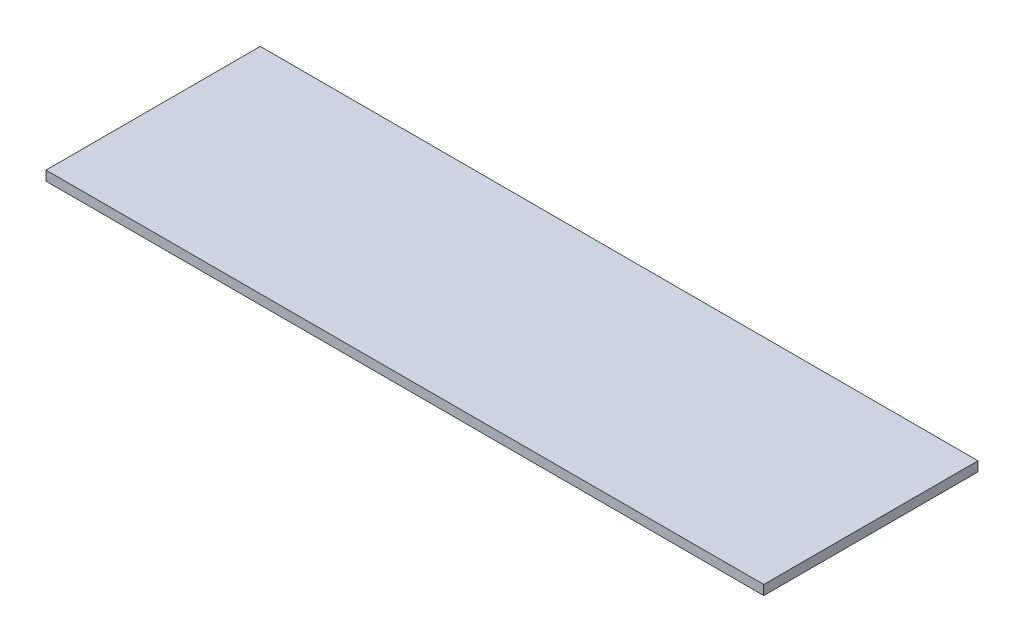
ISO-10303-21;
HEADER;
FILE_DESCRIPTION(('STEP AP214'),'2;1');
FILE_NAME('part.step','',(''),(''),'','','');
FILE_SCHEMA(('AUTOMOTIVE_DESIGN { 1 0 10303 214 1 1 1 1 }'));
ENDSEC;
DATA;
#1=APPLICATION_CONTEXT('core data for automotive mechanical design processes');
#2=APPLICATION_PROTOCOL_DEFINITION('international standard','automotive_design',2000,#1);
#3=PRODUCT_CONTEXT('',#1,'mechanical');
#4=PRODUCT('Part','Part','',(#3));
#5=PRODUCT_RELATED_PRODUCT_CATEGORY('part','',(#4));
#6=PRODUCT_DEFINITION_FORMATION('','',#4);
#7=PRODUCT_DEFINITION_CONTEXT('part definition',#1,'design');
#8=PRODUCT_DEFINITION('design','',#6,#7);
#9=PRODUCT_DEFINITION_SHAPE('','',#8);
#10=(LENGTH_UNIT() NAMED_UNIT(*) SI_UNIT(.MILLI.,.METRE.));
#11=(NAMED_UNIT(*) PLANE_ANGLE_UNIT() SI_UNIT($,.RADIAN.));
#12=(NAMED_UNIT(*) SI_UNIT($,.STERADIAN.) SOLID_ANGLE_UNIT());
#13=UNCERTAINTY_MEASURE_WITH_UNIT(LENGTH_MEASURE(1.E-05),#10,'distance_accuracy_value','');
#14=(GEOMETRIC_REPRESENTATION_CONTEXT(3) GLOBAL_UNCERTAINTY_ASSIGNED_CONTEXT((#13)) GLOBAL_UNIT_ASSIGNED_CONTEXT((#10,
#11,#12)) REPRESENTATION_CONTEXT('',''));
#15=CARTESIAN_POINT('',(0.,0.,0.));
#16=DIRECTION('',(0.,0.,1.));
#17=DIRECTION('',(1.,0.,0.));
#18=AXIS2_PLACEMENT_3D('',#15,#16,#17);
#19=CARTESIAN_POINT('',(0.,18.,0.));
#20=DIRECTION('',(1.,0.,0.));
#21=DIRECTION('',(0.,0.,-1.));
#22=AXIS2_PLACEMENT_3D('',#19,#20,#21);
#23=PLANE('',#22);
#24=DIRECTION('',(0.,0.,1.));
#25=VECTOR('',#24,1.);
#26=CARTESIAN_POINT('',(0.,0.,0.));
#27=LINE('',#26,#25);
#28=CARTESIAN_POINT('',(0.,0.,-400.));
#29=VERTEX_POINT('',#28);
#30=CARTESIAN_POINT('',(0.,0.,0.));
#31=VERTEX_POINT('',#30);
#32=EDGE_CURVE('E96',#29,#31,#27,.T.);
#33=ORIENTED_EDGE('',*,*,#32,.T.);
#34=DIRECTION('',(0.,-1.,0.));
#35=VECTOR('',#34,1.);
#36=CARTESIAN_POINT('',(0.,18.,0.));
#37=LINE('',#36,#35);
#38=CARTESIAN_POINT('',(0.,18.,0.));
#39=VERTEX_POINT('',#38);
#40=EDGE_CURVE('E11',#39,#31,#37,.T.);
#41=ORIENTED_EDGE('',*,*,#40,.F.);
#42=DIRECTION('',(0.,0.,1.));
#43=VECTOR('',#42,1.);
#44=CARTESIAN_POINT('',(0.,18.,0.));
#45=LINE('',#44,#43);
#46=CARTESIAN_POINT('',(0.,18.,-400.));
#47=VERTEX_POINT('',#46);
#48=EDGE_CURVE('E84',#47,#39,#45,.T.);
#49=ORIENTED_EDGE('',*,*,#48,.F.);
#50=DIRECTION('',(0.,-1.,0.));
#51=VECTOR('',#50,1.);
#52=CARTESIAN_POINT('',(0.,18.,-400.));
#53=LINE('',#52,#51);
#54=EDGE_CURVE('E92',#47,#29,#53,.T.);
#55=ORIENTED_EDGE('',*,*,#54,.T.);
#56=EDGE_LOOP('',(#33,#41,#49,#55));
#57=FACE_BOUND('',#56,.T.);
#58=ADVANCED_FACE('F33',(#57),#23,.F.);
#59=CARTESIAN_POINT('',(0.,18.,0.));
#60=DIRECTION('',(0.,0.,-1.));
#61=DIRECTION('',(-1.,0.,0.));
#62=AXIS2_PLACEMENT_3D('',#59,#60,#61);
#63=PLANE('',#62);
#64=DIRECTION('',(1.,0.,0.));
#65=VECTOR('',#64,1.);
#66=CARTESIAN_POINT('',(0.,0.,0.));
#67=LINE('',#66,#65);
#68=CARTESIAN_POINT('',(1340.,0.,0.));
#69=VERTEX_POINT('',#68);
#70=EDGE_CURVE('E88',#31,#69,#67,.T.);
#71=ORIENTED_EDGE('',*,*,#70,.T.);
#72=DIRECTION('',(0.,-1.,0.));
#73=VECTOR('',#72,1.);
#74=CARTESIAN_POINT('',(1340.,18.,0.));
#75=LINE('',#74,#73);
#76=CARTESIAN_POINT('',(1340.,18.,0.));
#77=VERTEX_POINT('',#76);
#78=EDGE_CURVE('E41',#77,#69,#75,.T.);
#79=ORIENTED_EDGE('',*,*,#78,.F.);
#80=DIRECTION('',(1.,0.,0.));
#81=VECTOR('',#80,1.);
#82=CARTESIAN_POINT('',(0.,18.,0.));
#83=LINE('',#82,#81);
#84=EDGE_CURVE('E79',#39,#77,#83,.T.);
#85=ORIENTED_EDGE('',*,*,#84,.F.);
#86=ORIENTED_EDGE('',*,*,#40,.T.);
#87=EDGE_LOOP('',(#71,#79,#85,#86));
#88=FACE_BOUND('',#87,.T.);
#89=ADVANCED_FACE('F87',(#88),#63,.F.);
#90=CARTESIAN_POINT('',(1340.,18.,0.));
#91=DIRECTION('',(-1.,0.,0.));
#92=DIRECTION('',(0.,0.,1.));
#93=AXIS2_PLACEMENT_3D('',#90,#91,#92);
#94=PLANE('',#93);
#95=DIRECTION('',(0.,0.,-1.));
#96=VECTOR('',#95,1.);
#97=CARTESIAN_POINT('',(1340.,0.,0.));
#98=LINE('',#97,#96);
#99=CARTESIAN_POINT('',(1340.,0.,-400.));
#100=VERTEX_POINT('',#99);
#101=EDGE_CURVE('E66',#69,#100,#98,.T.);
#102=ORIENTED_EDGE('',*,*,#101,.T.);
#103=DIRECTION('',(0.,-1.,0.));
#104=VECTOR('',#103,1.);
#105=CARTESIAN_POINT('',(1340.,18.,-400.));
#106=LINE('',#105,#104);
#107=CARTESIAN_POINT('',(1340.,18.,-400.));
#108=VERTEX_POINT('',#107);
#109=EDGE_CURVE('E89',#108,#100,#106,.T.);
#110=ORIENTED_EDGE('',*,*,#109,.F.);
#111=DIRECTION('',(0.,0.,-1.));
#112=VECTOR('',#111,1.);
#113=CARTESIAN_POINT('',(1340.,18.,0.));
#114=LINE('',#113,#112);
#115=EDGE_CURVE('E82',#77,#108,#114,.T.);
#116=ORIENTED_EDGE('',*,*,#115,.F.);
#117=ORIENTED_EDGE('',*,*,#78,.T.);
#118=EDGE_LOOP('',(#102,#110,#116,#117));
#119=FACE_BOUND('',#118,.T.);
#120=ADVANCED_FACE('F90',(#119),#94,.F.);
#121=CARTESIAN_POINT('',(0.,18.,-400.));
#122=DIRECTION('',(0.,0.,1.));
#123=DIRECTION('',(1.,0.,0.));
#124=AXIS2_PLACEMENT_3D('',#121,#122,#123);
#125=PLANE('',#124);
#126=DIRECTION('',(-1.,0.,0.));
#127=VECTOR('',#126,1.);
#128=CARTESIAN_POINT('',(0.,0.,-400.));
#129=LINE('',#128,#127);
#130=EDGE_CURVE('E72',#100,#29,#129,.T.);
#131=ORIENTED_EDGE('',*,*,#130,.T.);
#132=ORIENTED_EDGE('',*,*,#54,.F.);
#133=DIRECTION('',(-1.,0.,0.));
#134=VECTOR('',#133,1.);
#135=CARTESIAN_POINT('',(0.,18.,-400.));
#136=LINE('',#135,#134);
#137=EDGE_CURVE('E49',#108,#47,#136,.T.);
#138=ORIENTED_EDGE('',*,*,#137,.F.);
#139=ORIENTED_EDGE('',*,*,#109,.T.);
#140=EDGE_LOOP('',(#131,#132,#138,#139));
#141=FACE_BOUND('',#140,.T.);
#142=ADVANCED_FACE('F103',(#141),#125,.F.);
#143=CARTESIAN_POINT('',(0.,18.,0.));
#144=DIRECTION('',(0.,-1.,0.));
#145=DIRECTION('',(0.,0.,-1.));
#146=AXIS2_PLACEMENT_3D('',#143,#144,#145);
#147=PLANE('',#146);
#148=ORIENTED_EDGE('',*,*,#48,.T.);
#149=ORIENTED_EDGE('',*,*,#84,.T.);
#150=ORIENTED_EDGE('',*,*,#115,.T.);
#151=ORIENTED_EDGE('',*,*,#137,.T.);
#152=EDGE_LOOP('',(#148,#149,#150,#151));
#153=FACE_BOUND('',#152,.T.);
#154=ADVANCED_FACE('F80',(#153),#147,.F.);
#155=CARTESIAN_POINT('',(0.,0.,0.));
#156=DIRECTION('',(0.,-1.,0.));
#157=DIRECTION('',(0.,0.,-1.));
#158=AXIS2_PLACEMENT_3D('',#155,#156,#157);
#159=PLANE('',#158);
#160=ORIENTED_EDGE('',*,*,#32,.F.);
#161=ORIENTED_EDGE('',*,*,#130,.F.);
#162=ORIENTED_EDGE('',*,*,#101,.F.);
#163=ORIENTED_EDGE('',*,*,#70,.F.);
#164=EDGE_LOOP('',(#160,#161,#162,#163));
#165=FACE_BOUND('',#164,.T.);
#166=ADVANCED_FACE('F106',(#165),#159,.T.);
#167=CLOSED_SHELL('',(#58,#89,#120,#142,#154,#166));
#168=MANIFOLD_SOLID_BREP('B2',#167);
#169=ADVANCED_BREP_SHAPE_REPRESENTATION('',(#18,#168),#14);
#170=SHAPE_DEFINITION_REPRESENTATION(#9,#169);
ENDSEC;
END-ISO-10303-21;
